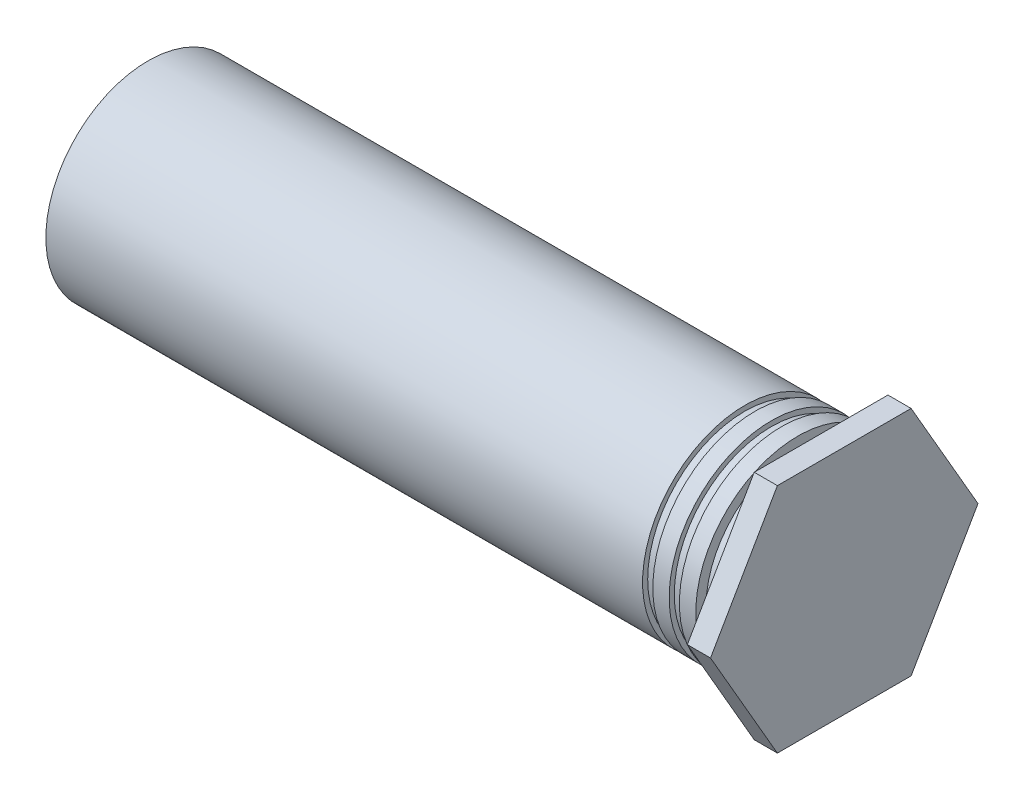
ISO-10303-21;
HEADER;
FILE_DESCRIPTION(('STEP AP214'),'2;1');
FILE_NAME('part.step','',(''),(''),'','','');
FILE_SCHEMA(('AUTOMOTIVE_DESIGN { 1 0 10303 214 1 1 1 1 }'));
ENDSEC;
DATA;
#1=APPLICATION_CONTEXT('core data for automotive mechanical design processes');
#2=APPLICATION_PROTOCOL_DEFINITION('international standard','automotive_design',2000,#1);
#3=PRODUCT_CONTEXT('',#1,'mechanical');
#4=PRODUCT('Part','Part','',(#3));
#5=PRODUCT_RELATED_PRODUCT_CATEGORY('part','',(#4));
#6=PRODUCT_DEFINITION_FORMATION('','',#4);
#7=PRODUCT_DEFINITION_CONTEXT('part definition',#1,'design');
#8=PRODUCT_DEFINITION('design','',#6,#7);
#9=PRODUCT_DEFINITION_SHAPE('','',#8);
#10=(LENGTH_UNIT() NAMED_UNIT(*) SI_UNIT(.MILLI.,.METRE.));
#11=(NAMED_UNIT(*) PLANE_ANGLE_UNIT() SI_UNIT($,.RADIAN.));
#12=(NAMED_UNIT(*) SI_UNIT($,.STERADIAN.) SOLID_ANGLE_UNIT());
#13=UNCERTAINTY_MEASURE_WITH_UNIT(LENGTH_MEASURE(1.E-05),#10,'distance_accuracy_value','');
#14=(GEOMETRIC_REPRESENTATION_CONTEXT(3) GLOBAL_UNCERTAINTY_ASSIGNED_CONTEXT((#13)) GLOBAL_UNIT_ASSIGNED_CONTEXT((#10,
#11,#12)) REPRESENTATION_CONTEXT('',''));
#15=CARTESIAN_POINT('',(0.,0.,0.));
#16=DIRECTION('',(0.,0.,1.));
#17=DIRECTION('',(1.,0.,0.));
#18=AXIS2_PLACEMENT_3D('',#15,#16,#17);
#19=CARTESIAN_POINT('',(0.47498,0.,0.));
#20=DIRECTION('',(1.,0.,0.));
#21=DIRECTION('',(0.,1.,0.));
#22=AXIS2_PLACEMENT_3D('',#19,#20,#21);
#23=PLANE('',#22);
#24=DIRECTION('',(0.,0.866025403784438,-0.5));
#25=VECTOR('',#24,1.);
#26=CARTESIAN_POINT('',(0.47498,0.,-2.74229830859689));
#27=LINE('',#26,#25);
#28=CARTESIAN_POINT('',(0.47498,0.,-2.74229830859689));
#29=VERTEX_POINT('',#28);
#30=CARTESIAN_POINT('',(0.47498,-2.3749,-1.37114915429844));
#31=VERTEX_POINT('',#30);
#32=EDGE_CURVE('E84',#29,#31,#27,.F.);
#33=ORIENTED_EDGE('',*,*,#32,.F.);
#34=DIRECTION('',(0.,0.866025403784439,0.5));
#35=VECTOR('',#34,1.);
#36=CARTESIAN_POINT('',(0.47498,2.3749,-1.37114915429844));
#37=LINE('',#36,#35);
#38=CARTESIAN_POINT('',(0.47498,2.3749,-1.37114915429844));
#39=VERTEX_POINT('',#38);
#40=EDGE_CURVE('E168',#39,#29,#37,.F.);
#41=ORIENTED_EDGE('',*,*,#40,.F.);
#42=DIRECTION('',(0.,0.,1.));
#43=VECTOR('',#42,1.);
#44=CARTESIAN_POINT('',(0.47498,2.3749,1.37114915429844));
#45=LINE('',#44,#43);
#46=CARTESIAN_POINT('',(0.47498,2.3749,1.37114915429844));
#47=VERTEX_POINT('',#46);
#48=EDGE_CURVE('E162',#47,#39,#45,.F.);
#49=ORIENTED_EDGE('',*,*,#48,.F.);
#50=DIRECTION('',(0.,-0.866025403784439,0.5));
#51=VECTOR('',#50,1.);
#52=CARTESIAN_POINT('',(0.47498,0.,2.74229830859688));
#53=LINE('',#52,#51);
#54=CARTESIAN_POINT('',(0.47498,0.,2.74229830859688));
#55=VERTEX_POINT('',#54);
#56=EDGE_CURVE('E73',#55,#47,#53,.F.);
#57=ORIENTED_EDGE('',*,*,#56,.F.);
#58=DIRECTION('',(0.,-0.866025403784439,-0.5));
#59=VECTOR('',#58,1.);
#60=CARTESIAN_POINT('',(0.47498,-2.3749,1.37114915429844));
#61=LINE('',#60,#59);
#62=CARTESIAN_POINT('',(0.47498,-2.3749,1.37114915429844));
#63=VERTEX_POINT('',#62);
#64=EDGE_CURVE('E70',#63,#55,#61,.F.);
#65=ORIENTED_EDGE('',*,*,#64,.F.);
#66=DIRECTION('',(0.,0.,-1.));
#67=VECTOR('',#66,1.);
#68=CARTESIAN_POINT('',(0.47498,-2.3749,-1.37114915429844));
#69=LINE('',#68,#67);
#70=EDGE_CURVE('E67',#31,#63,#69,.F.);
#71=ORIENTED_EDGE('',*,*,#70,.F.);
#72=EDGE_LOOP('',(#33,#41,#49,#57,#65,#71));
#73=FACE_BOUND('',#72,.T.);
#74=ADVANCED_FACE('F18',(#73),#23,.T.);
#75=CARTESIAN_POINT('',(0.,-2.3749,1.37114915429844));
#76=DIRECTION('',(0.,-0.5,0.866025403784439));
#77=DIRECTION('',(0.,-0.866025403784439,-0.5));
#78=AXIS2_PLACEMENT_3D('',#75,#76,#77);
#79=PLANE('',#78);
#80=DIRECTION('',(0.,-0.866025403784439,-0.499999999999999));
#81=VECTOR('',#80,1.);
#82=CARTESIAN_POINT('',(0.,0.,2.74229830859688));
#83=LINE('',#82,#81);
#84=CARTESIAN_POINT('',(0.,0.,2.74229830859688));
#85=VERTEX_POINT('',#84);
#86=CARTESIAN_POINT('',(0.,-2.3749,1.37114915429844));
#87=VERTEX_POINT('',#86);
#88=EDGE_CURVE('E81',#85,#87,#83,.T.);
#89=ORIENTED_EDGE('',*,*,#88,.T.);
#90=DIRECTION('',(1.,0.,0.));
#91=VECTOR('',#90,1.);
#92=CARTESIAN_POINT('',(0.,-2.3749,1.37114915429844));
#93=LINE('',#92,#91);
#94=EDGE_CURVE('E78',#63,#87,#93,.F.);
#95=ORIENTED_EDGE('',*,*,#94,.F.);
#96=ORIENTED_EDGE('',*,*,#64,.T.);
#97=DIRECTION('',(1.,0.,0.));
#98=VECTOR('',#97,1.);
#99=CARTESIAN_POINT('',(0.,0.,2.74229830859688));
#100=LINE('',#99,#98);
#101=EDGE_CURVE('E154',#85,#55,#100,.T.);
#102=ORIENTED_EDGE('',*,*,#101,.F.);
#103=EDGE_LOOP('',(#89,#95,#96,#102));
#104=FACE_BOUND('',#103,.T.);
#105=ADVANCED_FACE('F79',(#104),#79,.T.);
#106=CARTESIAN_POINT('',(0.,-2.3749,-1.37114915429844));
#107=DIRECTION('',(0.,-1.,0.));
#108=DIRECTION('',(0.,0.,-1.));
#109=AXIS2_PLACEMENT_3D('',#106,#107,#108);
#110=PLANE('',#109);
#111=DIRECTION('',(0.,0.,1.));
#112=VECTOR('',#111,1.);
#113=CARTESIAN_POINT('',(0.,-2.3749,0.));
#114=LINE('',#113,#112);
#115=CARTESIAN_POINT('',(0.,-2.3749,-1.37114915429844));
#116=VERTEX_POINT('',#115);
#117=EDGE_CURVE('E151',#87,#116,#114,.F.);
#118=ORIENTED_EDGE('',*,*,#117,.T.);
#119=DIRECTION('',(1.,0.,0.));
#120=VECTOR('',#119,1.);
#121=CARTESIAN_POINT('',(0.,-2.3749,-1.37114915429845));
#122=LINE('',#121,#120);
#123=EDGE_CURVE('E88',#31,#116,#122,.F.);
#124=ORIENTED_EDGE('',*,*,#123,.F.);
#125=ORIENTED_EDGE('',*,*,#70,.T.);
#126=ORIENTED_EDGE('',*,*,#94,.T.);
#127=EDGE_LOOP('',(#118,#124,#125,#126));
#128=FACE_BOUND('',#127,.T.);
#129=ADVANCED_FACE('F86',(#128),#110,.T.);
#130=CARTESIAN_POINT('',(0.,0.,-2.74229830859689));
#131=DIRECTION('',(0.,-0.5,-0.866025403784438));
#132=DIRECTION('',(0.,0.866025403784438,-0.5));
#133=AXIS2_PLACEMENT_3D('',#130,#131,#132);
#134=PLANE('',#133);
#135=DIRECTION('',(0.,0.866025403784437,-0.500000000000002));
#136=VECTOR('',#135,1.);
#137=CARTESIAN_POINT('',(0.,-2.3749,-1.37114915429844));
#138=LINE('',#137,#136);
#139=CARTESIAN_POINT('',(0.,0.,-2.74229830859689));
#140=VERTEX_POINT('',#139);
#141=EDGE_CURVE('E149',#116,#140,#138,.T.);
#142=ORIENTED_EDGE('',*,*,#141,.T.);
#143=DIRECTION('',(1.,0.,0.));
#144=VECTOR('',#143,1.);
#145=CARTESIAN_POINT('',(0.,0.,-2.74229830859688));
#146=LINE('',#145,#144);
#147=EDGE_CURVE('E165',#29,#140,#146,.F.);
#148=ORIENTED_EDGE('',*,*,#147,.F.);
#149=ORIENTED_EDGE('',*,*,#32,.T.);
#150=ORIENTED_EDGE('',*,*,#123,.T.);
#151=EDGE_LOOP('',(#142,#148,#149,#150));
#152=FACE_BOUND('',#151,.T.);
#153=ADVANCED_FACE('F173',(#152),#134,.T.);
#154=CARTESIAN_POINT('',(0.,2.3749,-1.37114915429844));
#155=DIRECTION('',(0.,0.5,-0.866025403784439));
#156=DIRECTION('',(0.,0.866025403784439,0.5));
#157=AXIS2_PLACEMENT_3D('',#154,#155,#156);
#158=PLANE('',#157);
#159=DIRECTION('',(0.,0.866025403784437,0.500000000000002));
#160=VECTOR('',#159,1.);
#161=CARTESIAN_POINT('',(0.,0.,-2.74229830859689));
#162=LINE('',#161,#160);
#163=CARTESIAN_POINT('',(0.,2.3749,-1.37114915429844));
#164=VERTEX_POINT('',#163);
#165=EDGE_CURVE('E143',#140,#164,#162,.T.);
#166=ORIENTED_EDGE('',*,*,#165,.T.);
#167=DIRECTION('',(1.,0.,0.));
#168=VECTOR('',#167,1.);
#169=CARTESIAN_POINT('',(0.,2.3749,-1.37114915429844));
#170=LINE('',#169,#168);
#171=EDGE_CURVE('E159',#39,#164,#170,.F.);
#172=ORIENTED_EDGE('',*,*,#171,.F.);
#173=ORIENTED_EDGE('',*,*,#40,.T.);
#174=ORIENTED_EDGE('',*,*,#147,.T.);
#175=EDGE_LOOP('',(#166,#172,#173,#174));
#176=FACE_BOUND('',#175,.T.);
#177=ADVANCED_FACE('F178',(#176),#158,.T.);
#178=CARTESIAN_POINT('',(0.,2.3749,1.37114915429844));
#179=DIRECTION('',(0.,1.,0.));
#180=DIRECTION('',(0.,0.,1.));
#181=AXIS2_PLACEMENT_3D('',#178,#179,#180);
#182=PLANE('',#181);
#183=DIRECTION('',(0.,0.,1.));
#184=VECTOR('',#183,1.);
#185=CARTESIAN_POINT('',(0.,2.3749,0.));
#186=LINE('',#185,#184);
#187=CARTESIAN_POINT('',(0.,2.3749,1.37114915429844));
#188=VERTEX_POINT('',#187);
#189=EDGE_CURVE('E138',#164,#188,#186,.T.);
#190=ORIENTED_EDGE('',*,*,#189,.T.);
#191=DIRECTION('',(1.,0.,0.));
#192=VECTOR('',#191,1.);
#193=CARTESIAN_POINT('',(0.,2.3749,1.37114915429844));
#194=LINE('',#193,#192);
#195=EDGE_CURVE('E156',#47,#188,#194,.F.);
#196=ORIENTED_EDGE('',*,*,#195,.F.);
#197=ORIENTED_EDGE('',*,*,#48,.T.);
#198=ORIENTED_EDGE('',*,*,#171,.T.);
#199=EDGE_LOOP('',(#190,#196,#197,#198));
#200=FACE_BOUND('',#199,.T.);
#201=ADVANCED_FACE('F182',(#200),#182,.T.);
#202=CARTESIAN_POINT('',(0.,0.,2.74229830859688));
#203=DIRECTION('',(0.,0.5,0.866025403784439));
#204=DIRECTION('',(0.,-0.866025403784439,0.5));
#205=AXIS2_PLACEMENT_3D('',#202,#203,#204);
#206=PLANE('',#205);
#207=DIRECTION('',(0.,-0.866025403784439,0.499999999999999));
#208=VECTOR('',#207,1.);
#209=CARTESIAN_POINT('',(0.,2.3749,1.37114915429844));
#210=LINE('',#209,#208);
#211=EDGE_CURVE('E134',#188,#85,#210,.T.);
#212=ORIENTED_EDGE('',*,*,#211,.T.);
#213=ORIENTED_EDGE('',*,*,#101,.T.);
#214=ORIENTED_EDGE('',*,*,#56,.T.);
#215=ORIENTED_EDGE('',*,*,#195,.T.);
#216=EDGE_LOOP('',(#212,#213,#214,#215));
#217=FACE_BOUND('',#216,.T.);
#218=ADVANCED_FACE('F183',(#217),#206,.T.);
#219=CARTESIAN_POINT('',(0.,0.,0.));
#220=DIRECTION('',(1.,0.,0.));
#221=DIRECTION('',(0.,1.,0.));
#222=AXIS2_PLACEMENT_3D('',#219,#220,#221);
#223=PLANE('',#222);
#224=CARTESIAN_POINT('',(0.,0.,0.));
#225=DIRECTION('',(1.,0.,0.));
#226=DIRECTION('',(0.,0.,-1.));
#227=AXIS2_PLACEMENT_3D('',#224,#225,#226);
#228=CIRCLE('',#227,1.88595);
#229=CARTESIAN_POINT('',(0.,0.,-1.88595));
#230=VERTEX_POINT('',#229);
#231=EDGE_CURVE('E21',#230,#230,#228,.F.);
#232=ORIENTED_EDGE('',*,*,#231,.F.);
#233=EDGE_LOOP('',(#232));
#234=FACE_BOUND('',#233,.T.);
#235=ORIENTED_EDGE('',*,*,#189,.F.);
#236=ORIENTED_EDGE('',*,*,#165,.F.);
#237=ORIENTED_EDGE('',*,*,#141,.F.);
#238=ORIENTED_EDGE('',*,*,#117,.F.);
#239=ORIENTED_EDGE('',*,*,#88,.F.);
#240=ORIENTED_EDGE('',*,*,#211,.F.);
#241=EDGE_LOOP('',(#235,#236,#237,#238,#239,#240));
#242=FACE_BOUND('',#241,.T.);
#243=ADVANCED_FACE('F185',(#234,#242),#223,.F.);
#244=CARTESIAN_POINT('',(-0.23749,0.,0.));
#245=DIRECTION('',(1.,0.,0.));
#246=DIRECTION('',(0.,0.,-1.));
#247=AXIS2_PLACEMENT_3D('',#244,#245,#246);
#248=CYLINDRICAL_SURFACE('',#247,1.88595);
#249=CARTESIAN_POINT('',(-0.47498,0.,0.));
#250=DIRECTION('',(1.,0.,0.));
#251=DIRECTION('',(0.,0.,-1.));
#252=AXIS2_PLACEMENT_3D('',#249,#250,#251);
#253=CIRCLE('',#252,1.88595);
#254=CARTESIAN_POINT('',(-0.474979999999999,0.,-1.88595));
#255=VERTEX_POINT('',#254);
#256=EDGE_CURVE('E129',#255,#255,#253,.F.);
#257=ORIENTED_EDGE('',*,*,#256,.F.);
#258=EDGE_LOOP('',(#257));
#259=FACE_BOUND('',#258,.T.);
#260=ORIENTED_EDGE('',*,*,#231,.T.);
#261=EDGE_LOOP('',(#260));
#262=FACE_BOUND('',#261,.T.);
#263=ADVANCED_FACE('F192',(#259,#262),#248,.T.);
#264=CARTESIAN_POINT('',(-0.47498,0.,1.04775));
#265=DIRECTION('',(1.,0.,0.));
#266=DIRECTION('',(0.,0.,-1.));
#267=AXIS2_PLACEMENT_3D('',#264,#265,#266);
#268=PLANE('',#267);
#269=CARTESIAN_POINT('',(-0.47498,0.,0.));
#270=DIRECTION('',(1.,0.,0.));
#271=DIRECTION('',(0.,0.,-1.));
#272=AXIS2_PLACEMENT_3D('',#269,#270,#271);
#273=CIRCLE('',#272,2.0955);
#274=CARTESIAN_POINT('',(-0.474979999999999,0.,-2.0955));
#275=VERTEX_POINT('',#274);
#276=EDGE_CURVE('E127',#275,#275,#273,.F.);
#277=ORIENTED_EDGE('',*,*,#276,.F.);
#278=EDGE_LOOP('',(#277));
#279=FACE_BOUND('',#278,.T.);
#280=ORIENTED_EDGE('',*,*,#256,.T.);
#281=EDGE_LOOP('',(#280));
#282=FACE_BOUND('',#281,.T.);
#283=ADVANCED_FACE('F259',(#279,#282),#268,.T.);
#284=CARTESIAN_POINT('',(-7.1374,0.,0.));
#285=DIRECTION('',(1.,0.,0.));
#286=DIRECTION('',(0.,0.,-1.));
#287=AXIS2_PLACEMENT_3D('',#284,#285,#286);
#288=CYLINDRICAL_SURFACE('',#287,2.0955);
#289=CARTESIAN_POINT('',(-0.81026,0.,0.));
#290=DIRECTION('',(1.,0.,0.));
#291=DIRECTION('',(0.,0.,-1.));
#292=AXIS2_PLACEMENT_3D('',#289,#290,#291);
#293=CIRCLE('',#292,2.0955);
#294=CARTESIAN_POINT('',(-0.81026,0.,-2.0955));
#295=VERTEX_POINT('',#294);
#296=EDGE_CURVE('E124',#295,#295,#293,.T.);
#297=ORIENTED_EDGE('',*,*,#296,.T.);
#298=EDGE_LOOP('',(#297));
#299=FACE_BOUND('',#298,.T.);
#300=ORIENTED_EDGE('',*,*,#276,.T.);
#301=EDGE_LOOP('',(#300));
#302=FACE_BOUND('',#301,.T.);
#303=ADVANCED_FACE('F255',(#299,#302),#288,.T.);
#304=CARTESIAN_POINT('',(-0.81026,0.,2.0431125));
#305=DIRECTION('',(1.,0.,0.));
#306=DIRECTION('',(0.,0.,-1.));
#307=AXIS2_PLACEMENT_3D('',#304,#305,#306);
#308=PLANE('',#307);
#309=ORIENTED_EDGE('',*,*,#296,.F.);
#310=EDGE_LOOP('',(#309));
#311=FACE_BOUND('',#310,.T.);
#312=CARTESIAN_POINT('',(-0.81026,0.,0.));
#313=DIRECTION('',(1.,0.,0.));
#314=DIRECTION('',(0.,0.,-1.));
#315=AXIS2_PLACEMENT_3D('',#312,#313,#314);
#316=CIRCLE('',#315,1.990725);
#317=CARTESIAN_POINT('',(-0.81026,0.,-1.990725));
#318=VERTEX_POINT('',#317);
#319=EDGE_CURVE('E121',#318,#318,#316,.F.);
#320=ORIENTED_EDGE('',*,*,#319,.F.);
#321=EDGE_LOOP('',(#320));
#322=FACE_BOUND('',#321,.T.);
#323=ADVANCED_FACE('F251',(#311,#322),#308,.F.);
#324=CARTESIAN_POINT('',(-3.48741999999902,0.,0.));
#325=DIRECTION('',(-1.,0.,0.));
#326=DIRECTION('',(0.,-1.,0.));
#327=AXIS2_PLACEMENT_3D('',#324,#325,#326);
#328=CONICAL_SURFACE('',#327,1.07822999996188,1.04719755121375);
#329=CARTESIAN_POINT('',(-3.48742,0.,0.));
#330=DIRECTION('',(-1.,0.,0.));
#331=DIRECTION('',(0.,0.,1.));
#332=AXIS2_PLACEMENT_3D('',#329,#330,#331);
#333=CIRCLE('',#332,1.07823);
#334=CARTESIAN_POINT('',(-3.48742,0.,1.07823));
#335=VERTEX_POINT('',#334);
#336=EDGE_CURVE('E120',#335,#335,#333,.T.);
#337=ORIENTED_EDGE('',*,*,#336,.T.);
#338=EDGE_LOOP('',(#337));
#339=FACE_BOUND('',#338,.T.);
#340=CARTESIAN_POINT('',(-2.86490361929737,0.,0.));
#341=VERTEX_POINT('',#340);
#342=VERTEX_LOOP('',#341);
#343=FACE_BOUND('',#342,.T.);
#344=ADVANCED_FACE('F247',(#339,#343),#328,.F.);
#345=CARTESIAN_POINT('',(-0.915035,0.,0.));
#346=DIRECTION('',(1.,0.,0.));
#347=DIRECTION('',(0.,0.,-1.));
#348=AXIS2_PLACEMENT_3D('',#345,#346,#347);
#349=CYLINDRICAL_SURFACE('',#348,1.990725);
#350=CARTESIAN_POINT('',(-1.01981,0.,0.));
#351=DIRECTION('',(1.,0.,0.));
#352=DIRECTION('',(0.,0.,-1.));
#353=AXIS2_PLACEMENT_3D('',#350,#351,#352);
#354=CIRCLE('',#353,1.990725);
#355=CARTESIAN_POINT('',(-1.01981,0.,-1.990725));
#356=VERTEX_POINT('',#355);
#357=EDGE_CURVE('E117',#356,#356,#354,.T.);
#358=ORIENTED_EDGE('',*,*,#357,.T.);
#359=EDGE_LOOP('',(#358));
#360=FACE_BOUND('',#359,.T.);
#361=ORIENTED_EDGE('',*,*,#319,.T.);
#362=EDGE_LOOP('',(#361));
#363=FACE_BOUND('',#362,.T.);
#364=ADVANCED_FACE('F243',(#360,#363),#349,.T.);
#365=CARTESIAN_POINT('',(-5.46862,0.,0.));
#366=DIRECTION('',(-1.,0.,0.));
#367=DIRECTION('',(0.,0.,1.));
#368=AXIS2_PLACEMENT_3D('',#365,#366,#367);
#369=CYLINDRICAL_SURFACE('',#368,1.07823);
#370=ORIENTED_EDGE('',*,*,#336,.F.);
#371=EDGE_LOOP('',(#370));
#372=FACE_BOUND('',#371,.T.);
#373=CARTESIAN_POINT('',(-7.44982,0.,0.));
#374=DIRECTION('',(-1.,0.,0.));
#375=DIRECTION('',(0.,0.,1.));
#376=AXIS2_PLACEMENT_3D('',#373,#374,#375);
#377=CIRCLE('',#376,1.07823);
#378=CARTESIAN_POINT('',(-7.44982,0.,1.07823));
#379=VERTEX_POINT('',#378);
#380=EDGE_CURVE('E114',#379,#379,#377,.F.);
#381=ORIENTED_EDGE('',*,*,#380,.F.);
#382=EDGE_LOOP('',(#381));
#383=FACE_BOUND('',#382,.T.);
#384=ADVANCED_FACE('F239',(#372,#383),#369,.F.);
#385=CARTESIAN_POINT('',(-1.01981,0.,2.0431125));
#386=DIRECTION('',(-1.,0.,0.));
#387=DIRECTION('',(0.,0.,1.));
#388=AXIS2_PLACEMENT_3D('',#385,#386,#387);
#389=PLANE('',#388);
#390=ORIENTED_EDGE('',*,*,#357,.F.);
#391=EDGE_LOOP('',(#390));
#392=FACE_BOUND('',#391,.T.);
#393=CARTESIAN_POINT('',(-1.01981,0.,0.));
#394=DIRECTION('',(1.,0.,0.));
#395=DIRECTION('',(0.,0.,-1.));
#396=AXIS2_PLACEMENT_3D('',#393,#394,#395);
#397=CIRCLE('',#396,2.0955);
#398=CARTESIAN_POINT('',(-1.01981,0.,-2.0955));
#399=VERTEX_POINT('',#398);
#400=EDGE_CURVE('E111',#399,#399,#397,.F.);
#401=ORIENTED_EDGE('',*,*,#400,.F.);
#402=EDGE_LOOP('',(#401));
#403=FACE_BOUND('',#402,.T.);
#404=ADVANCED_FACE('F235',(#392,#403),#389,.F.);
#405=CARTESIAN_POINT('',(-7.44982,0.,-1.186815));
#406=DIRECTION('',(1.,0.,0.));
#407=DIRECTION('',(0.,0.,-1.));
#408=AXIS2_PLACEMENT_3D('',#405,#406,#407);
#409=PLANE('',#408);
#410=ORIENTED_EDGE('',*,*,#380,.T.);
#411=EDGE_LOOP('',(#410));
#412=FACE_BOUND('',#411,.T.);
#413=CARTESIAN_POINT('',(-7.44982,0.,0.));
#414=DIRECTION('',(-1.,0.,0.));
#415=DIRECTION('',(0.,0.,1.));
#416=AXIS2_PLACEMENT_3D('',#413,#414,#415);
#417=CIRCLE('',#416,0.95123);
#418=CARTESIAN_POINT('',(-7.44982,0.,0.951230000000001));
#419=VERTEX_POINT('',#418);
#420=EDGE_CURVE('E108',#419,#419,#417,.T.);
#421=ORIENTED_EDGE('',*,*,#420,.T.);
#422=EDGE_LOOP('',(#421));
#423=FACE_BOUND('',#422,.T.);
#424=ADVANCED_FACE('F231',(#412,#423),#409,.T.);
#425=CARTESIAN_POINT('',(-7.1374,0.,0.));
#426=DIRECTION('',(1.,0.,0.));
#427=DIRECTION('',(0.,0.,-1.));
#428=AXIS2_PLACEMENT_3D('',#425,#426,#427);
#429=CYLINDRICAL_SURFACE('',#428,2.0955);
#430=CARTESIAN_POINT('',(-1.35509,0.,0.));
#431=DIRECTION('',(1.,0.,0.));
#432=DIRECTION('',(0.,0.,-1.));
#433=AXIS2_PLACEMENT_3D('',#430,#431,#432);
#434=CIRCLE('',#433,2.0955);
#435=CARTESIAN_POINT('',(-1.35509,0.,-2.0955));
#436=VERTEX_POINT('',#435);
#437=EDGE_CURVE('E105',#436,#436,#434,.T.);
#438=ORIENTED_EDGE('',*,*,#437,.T.);
#439=EDGE_LOOP('',(#438));
#440=FACE_BOUND('',#439,.T.);
#441=ORIENTED_EDGE('',*,*,#400,.T.);
#442=EDGE_LOOP('',(#441));
#443=FACE_BOUND('',#442,.T.);
#444=ADVANCED_FACE('F227',(#440,#443),#429,.T.);
#445=CARTESIAN_POINT('',(-10.389235,0.,0.));
#446=DIRECTION('',(-1.,0.,0.));
#447=DIRECTION('',(0.,0.,1.));
#448=AXIS2_PLACEMENT_3D('',#445,#446,#447);
#449=CYLINDRICAL_SURFACE('',#448,0.95123);
#450=CARTESIAN_POINT('',(-13.3286500000054,0.,0.));
#451=DIRECTION('',(-1.,0.,0.));
#452=DIRECTION('',(0.,0.,-1.));
#453=AXIS2_PLACEMENT_3D('',#450,#451,#452);
#454=CIRCLE('',#453,0.951229999941461);
#455=CARTESIAN_POINT('',(-13.3286500000054,0.,-0.951229999941461));
#456=VERTEX_POINT('',#455);
#457=EDGE_CURVE('E104',#456,#456,#454,.T.);
#458=ORIENTED_EDGE('',*,*,#457,.T.);
#459=EDGE_LOOP('',(#458));
#460=FACE_BOUND('',#459,.T.);
#461=ORIENTED_EDGE('',*,*,#420,.F.);
#462=EDGE_LOOP('',(#461));
#463=FACE_BOUND('',#462,.T.);
#464=ADVANCED_FACE('F223',(#460,#463),#449,.F.);
#465=CARTESIAN_POINT('',(-1.35509,0.,2.0431125));
#466=DIRECTION('',(1.,0.,0.));
#467=DIRECTION('',(0.,0.,-1.));
#468=AXIS2_PLACEMENT_3D('',#465,#466,#467);
#469=PLANE('',#468);
#470=ORIENTED_EDGE('',*,*,#437,.F.);
#471=EDGE_LOOP('',(#470));
#472=FACE_BOUND('',#471,.T.);
#473=CARTESIAN_POINT('',(-1.35509,0.,0.));
#474=DIRECTION('',(1.,0.,0.));
#475=DIRECTION('',(0.,0.,-1.));
#476=AXIS2_PLACEMENT_3D('',#473,#474,#475);
#477=CIRCLE('',#476,1.990725);
#478=CARTESIAN_POINT('',(-1.35509,0.,-1.990725));
#479=VERTEX_POINT('',#478);
#480=EDGE_CURVE('E101',#479,#479,#477,.F.);
#481=ORIENTED_EDGE('',*,*,#480,.F.);
#482=EDGE_LOOP('',(#481));
#483=FACE_BOUND('',#482,.T.);
#484=ADVANCED_FACE('F219',(#472,#483),#469,.F.);
#485=CARTESIAN_POINT('',(-13.7998200000879,0.,0.));
#486=DIRECTION('',(-1.,0.,0.));
#487=DIRECTION('',(0.,-1.,0.));
#488=AXIS2_PLACEMENT_3D('',#485,#486,#487);
#489=CONICAL_SURFACE('',#488,1.42240000002403,0.785398163397448);
#490=CARTESIAN_POINT('',(-13.7998200000311,0.,0.));
#491=DIRECTION('',(-1.,0.,0.));
#492=DIRECTION('',(0.,-1.,0.));
#493=AXIS2_PLACEMENT_3D('',#490,#491,#492);
#494=CIRCLE('',#493,1.42239999996718);
#495=CARTESIAN_POINT('',(-13.7998200000311,-1.42239999996718,0.));
#496=VERTEX_POINT('',#495);
#497=EDGE_CURVE('E98',#496,#496,#494,.F.);
#498=ORIENTED_EDGE('',*,*,#497,.F.);
#499=EDGE_LOOP('',(#498));
#500=FACE_BOUND('',#499,.T.);
#501=ORIENTED_EDGE('',*,*,#457,.F.);
#502=EDGE_LOOP('',(#501));
#503=FACE_BOUND('',#502,.T.);
#504=ADVANCED_FACE('F215',(#500,#503),#489,.F.);
#505=CARTESIAN_POINT('',(-1.459865,0.,0.));
#506=DIRECTION('',(1.,0.,0.));
#507=DIRECTION('',(0.,0.,-1.));
#508=AXIS2_PLACEMENT_3D('',#505,#506,#507);
#509=CYLINDRICAL_SURFACE('',#508,1.990725);
#510=CARTESIAN_POINT('',(-1.56464,0.,0.));
#511=DIRECTION('',(1.,0.,0.));
#512=DIRECTION('',(0.,0.,-1.));
#513=AXIS2_PLACEMENT_3D('',#510,#511,#512);
#514=CIRCLE('',#513,1.990725);
#515=CARTESIAN_POINT('',(-1.56464,0.,-1.990725));
#516=VERTEX_POINT('',#515);
#517=EDGE_CURVE('E95',#516,#516,#514,.T.);
#518=ORIENTED_EDGE('',*,*,#517,.T.);
#519=EDGE_LOOP('',(#518));
#520=FACE_BOUND('',#519,.T.);
#521=ORIENTED_EDGE('',*,*,#480,.T.);
#522=EDGE_LOOP('',(#521));
#523=FACE_BOUND('',#522,.T.);
#524=ADVANCED_FACE('F211',(#520,#523),#509,.T.);
#525=CARTESIAN_POINT('',(-13.79982,0.,1.04775));
#526=DIRECTION('',(-1.,0.,0.));
#527=DIRECTION('',(0.,0.,1.));
#528=AXIS2_PLACEMENT_3D('',#525,#526,#527);
#529=PLANE('',#528);
#530=CARTESIAN_POINT('',(-13.79982,0.,0.));
#531=DIRECTION('',(1.,0.,0.));
#532=DIRECTION('',(0.,0.,-1.));
#533=AXIS2_PLACEMENT_3D('',#530,#531,#532);
#534=CIRCLE('',#533,2.0955);
#535=CARTESIAN_POINT('',(-13.79982,0.,-2.0955));
#536=VERTEX_POINT('',#535);
#537=EDGE_CURVE('E27',#536,#536,#534,.T.);
#538=ORIENTED_EDGE('',*,*,#537,.F.);
#539=EDGE_LOOP('',(#538));
#540=FACE_BOUND('',#539,.T.);
#541=ORIENTED_EDGE('',*,*,#497,.T.);
#542=EDGE_LOOP('',(#541));
#543=FACE_BOUND('',#542,.T.);
#544=ADVANCED_FACE('F204',(#540,#543),#529,.T.);
#545=CARTESIAN_POINT('',(-1.56464,0.,2.0431125));
#546=DIRECTION('',(-1.,0.,0.));
#547=DIRECTION('',(0.,0.,1.));
#548=AXIS2_PLACEMENT_3D('',#545,#546,#547);
#549=PLANE('',#548);
#550=ORIENTED_EDGE('',*,*,#517,.F.);
#551=EDGE_LOOP('',(#550));
#552=FACE_BOUND('',#551,.T.);
#553=CARTESIAN_POINT('',(-1.56464,0.,0.));
#554=DIRECTION('',(1.,0.,0.));
#555=DIRECTION('',(0.,0.,-1.));
#556=AXIS2_PLACEMENT_3D('',#553,#554,#555);
#557=CIRCLE('',#556,2.0955);
#558=CARTESIAN_POINT('',(-1.56464,0.,-2.0955));
#559=VERTEX_POINT('',#558);
#560=EDGE_CURVE('E11',#559,#559,#557,.F.);
#561=ORIENTED_EDGE('',*,*,#560,.F.);
#562=EDGE_LOOP('',(#561));
#563=FACE_BOUND('',#562,.T.);
#564=ADVANCED_FACE('F198',(#552,#563),#549,.F.);
#565=CARTESIAN_POINT('',(-7.1374,0.,0.));
#566=DIRECTION('',(1.,0.,0.));
#567=DIRECTION('',(0.,0.,-1.));
#568=AXIS2_PLACEMENT_3D('',#565,#566,#567);
#569=CYLINDRICAL_SURFACE('',#568,2.0955);
#570=ORIENTED_EDGE('',*,*,#537,.T.);
#571=EDGE_LOOP('',(#570));
#572=FACE_BOUND('',#571,.T.);
#573=ORIENTED_EDGE('',*,*,#560,.T.);
#574=EDGE_LOOP('',(#573));
#575=FACE_BOUND('',#574,.T.);
#576=ADVANCED_FACE('F196',(#572,#575),#569,.T.);
#577=CLOSED_SHELL('',(#74,#105,#129,#153,#177,#201,#218,#243,#263,#283,#303,#323,#344,#364,#384,
#404,#424,#444,#464,#484,#504,#524,#544,#564,#576));
#578=MANIFOLD_SOLID_BREP('B1',#577);
#579=ADVANCED_BREP_SHAPE_REPRESENTATION('',(#18,#578),#14);
#580=SHAPE_DEFINITION_REPRESENTATION(#9,#579);
ENDSEC;
END-ISO-10303-21;
